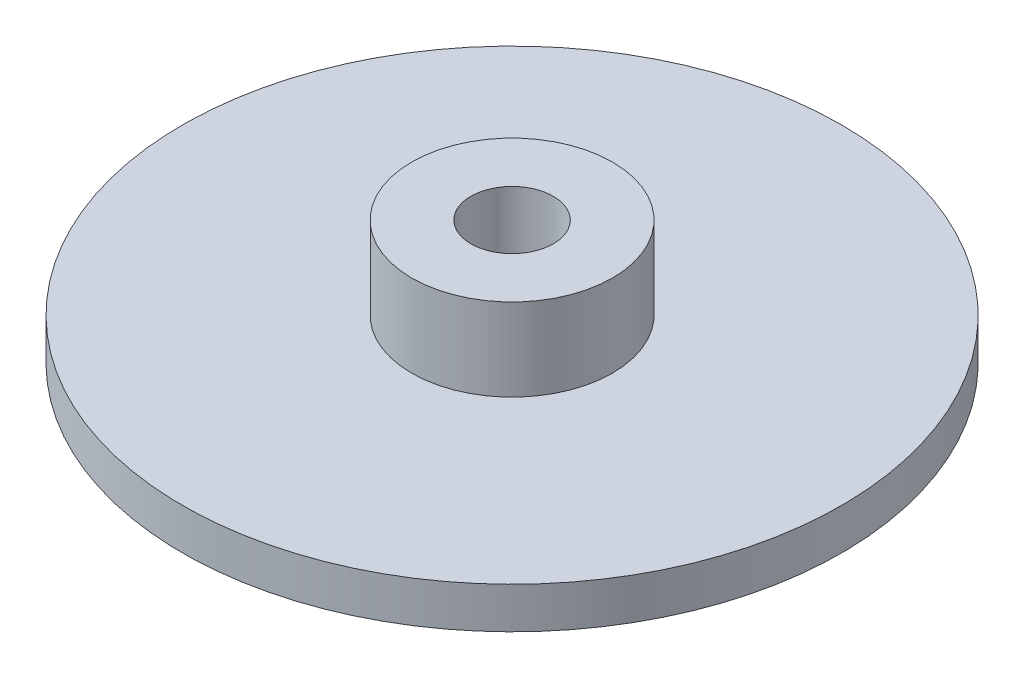
ISO-10303-21;
HEADER;
FILE_DESCRIPTION(('STEP AP214'),'2;1');
FILE_NAME('part.step','',(''),(''),'','','');
FILE_SCHEMA(('AUTOMOTIVE_DESIGN { 1 0 10303 214 1 1 1 1 }'));
ENDSEC;
DATA;
#1=APPLICATION_CONTEXT('core data for automotive mechanical design processes');
#2=APPLICATION_PROTOCOL_DEFINITION('international standard','automotive_design',2000,#1);
#3=PRODUCT_CONTEXT('',#1,'mechanical');
#4=PRODUCT('Part','Part','',(#3));
#5=PRODUCT_RELATED_PRODUCT_CATEGORY('part','',(#4));
#6=PRODUCT_DEFINITION_FORMATION('','',#4);
#7=PRODUCT_DEFINITION_CONTEXT('part definition',#1,'design');
#8=PRODUCT_DEFINITION('design','',#6,#7);
#9=PRODUCT_DEFINITION_SHAPE('','',#8);
#10=(LENGTH_UNIT() NAMED_UNIT(*) SI_UNIT(.MILLI.,.METRE.));
#11=(NAMED_UNIT(*) PLANE_ANGLE_UNIT() SI_UNIT($,.RADIAN.));
#12=(NAMED_UNIT(*) SI_UNIT($,.STERADIAN.) SOLID_ANGLE_UNIT());
#13=UNCERTAINTY_MEASURE_WITH_UNIT(LENGTH_MEASURE(1.E-05),#10,'distance_accuracy_value','');
#14=(GEOMETRIC_REPRESENTATION_CONTEXT(3) GLOBAL_UNCERTAINTY_ASSIGNED_CONTEXT((#13)) GLOBAL_UNIT_ASSIGNED_CONTEXT((#10,
#11,#12)) REPRESENTATION_CONTEXT('',''));
#15=CARTESIAN_POINT('',(0.,0.,0.));
#16=DIRECTION('',(0.,0.,1.));
#17=DIRECTION('',(1.,0.,0.));
#18=AXIS2_PLACEMENT_3D('',#15,#16,#17);
#19=CARTESIAN_POINT('',(0.,9.525,0.));
#20=DIRECTION('',(0.,-1.,0.));
#21=DIRECTION('',(0.,0.,-1.));
#22=AXIS2_PLACEMENT_3D('',#19,#20,#21);
#23=CYLINDRICAL_SURFACE('',#22,7.7390625);
#24=CARTESIAN_POINT('',(0.,3.175,0.));
#25=DIRECTION('',(0.,-1.,0.));
#26=DIRECTION('',(0.,0.,-1.));
#27=AXIS2_PLACEMENT_3D('',#24,#25,#26);
#28=CIRCLE('',#27,7.7390625);
#29=CARTESIAN_POINT('',(0.,3.175,-7.7390625));
#30=VERTEX_POINT('',#29);
#31=EDGE_CURVE('E33',#30,#30,#28,.T.);
#32=ORIENTED_EDGE('',*,*,#31,.F.);
#33=EDGE_LOOP('',(#32));
#34=FACE_BOUND('',#33,.T.);
#35=CARTESIAN_POINT('',(0.,9.525,0.));
#36=DIRECTION('',(0.,-1.,0.));
#37=DIRECTION('',(0.,0.,-1.));
#38=AXIS2_PLACEMENT_3D('',#35,#36,#37);
#39=CIRCLE('',#38,7.7390625);
#40=CARTESIAN_POINT('',(0.,9.525,-7.7390625));
#41=VERTEX_POINT('',#40);
#42=EDGE_CURVE('E17',#41,#41,#39,.F.);
#43=ORIENTED_EDGE('',*,*,#42,.F.);
#44=EDGE_LOOP('',(#43));
#45=FACE_BOUND('',#44,.T.);
#46=ADVANCED_FACE('F14',(#34,#45),#23,.T.);
#47=CARTESIAN_POINT('',(0.,9.525,0.));
#48=DIRECTION('',(0.,1.,0.));
#49=DIRECTION('',(0.,0.,1.));
#50=AXIS2_PLACEMENT_3D('',#47,#48,#49);
#51=PLANE('',#50);
#52=ORIENTED_EDGE('',*,*,#42,.T.);
#53=EDGE_LOOP('',(#52));
#54=FACE_BOUND('',#53,.T.);
#55=CARTESIAN_POINT('',(0.,9.525,0.));
#56=DIRECTION('',(0.,1.,0.));
#57=DIRECTION('',(0.,0.,1.));
#58=AXIS2_PLACEMENT_3D('',#55,#56,#57);
#59=CIRCLE('',#58,3.175);
#60=CARTESIAN_POINT('',(0.,9.525,3.175));
#61=VERTEX_POINT('',#60);
#62=EDGE_CURVE('E31',#61,#61,#59,.F.);
#63=ORIENTED_EDGE('',*,*,#62,.T.);
#64=EDGE_LOOP('',(#63));
#65=FACE_BOUND('',#64,.T.);
#66=ADVANCED_FACE('F40',(#54,#65),#51,.T.);
#67=CARTESIAN_POINT('',(0.,3.175,0.));
#68=DIRECTION('',(0.,1.,0.));
#69=DIRECTION('',(0.,0.,1.));
#70=AXIS2_PLACEMENT_3D('',#67,#68,#69);
#71=PLANE('',#70);
#72=ORIENTED_EDGE('',*,*,#31,.T.);
#73=EDGE_LOOP('',(#72));
#74=FACE_BOUND('',#73,.T.);
#75=CARTESIAN_POINT('',(0.,3.175,0.));
#76=DIRECTION('',(0.,-1.,0.));
#77=DIRECTION('',(0.,0.,-1.));
#78=AXIS2_PLACEMENT_3D('',#75,#76,#77);
#79=CIRCLE('',#78,25.4);
#80=CARTESIAN_POINT('',(0.,3.175,-25.4));
#81=VERTEX_POINT('',#80);
#82=EDGE_CURVE('E26',#81,#81,#79,.T.);
#83=ORIENTED_EDGE('',*,*,#82,.F.);
#84=EDGE_LOOP('',(#83));
#85=FACE_BOUND('',#84,.T.);
#86=ADVANCED_FACE('F49',(#74,#85),#71,.T.);
#87=CARTESIAN_POINT('',(0.,0.,0.));
#88=DIRECTION('',(0.,1.,0.));
#89=DIRECTION('',(0.,0.,1.));
#90=AXIS2_PLACEMENT_3D('',#87,#88,#89);
#91=CYLINDRICAL_SURFACE('',#90,3.175);
#92=CARTESIAN_POINT('',(0.,0.,0.));
#93=DIRECTION('',(0.,1.,0.));
#94=DIRECTION('',(0.,0.,1.));
#95=AXIS2_PLACEMENT_3D('',#92,#93,#94);
#96=CIRCLE('',#95,3.175);
#97=CARTESIAN_POINT('',(0.,0.,3.175));
#98=VERTEX_POINT('',#97);
#99=EDGE_CURVE('E21',#98,#98,#96,.F.);
#100=ORIENTED_EDGE('',*,*,#99,.T.);
#101=EDGE_LOOP('',(#100));
#102=FACE_BOUND('',#101,.T.);
#103=ORIENTED_EDGE('',*,*,#62,.F.);
#104=EDGE_LOOP('',(#103));
#105=FACE_BOUND('',#104,.T.);
#106=ADVANCED_FACE('F58',(#102,#105),#91,.F.);
#107=CARTESIAN_POINT('',(0.,3.175,0.));
#108=DIRECTION('',(0.,-1.,0.));
#109=DIRECTION('',(0.,0.,-1.));
#110=AXIS2_PLACEMENT_3D('',#107,#108,#109);
#111=CYLINDRICAL_SURFACE('',#110,25.4);
#112=ORIENTED_EDGE('',*,*,#82,.T.);
#113=EDGE_LOOP('',(#112));
#114=FACE_BOUND('',#113,.T.);
#115=CARTESIAN_POINT('',(0.,0.,0.));
#116=DIRECTION('',(0.,-1.,0.));
#117=DIRECTION('',(0.,0.,-1.));
#118=AXIS2_PLACEMENT_3D('',#115,#116,#117);
#119=CIRCLE('',#118,25.4);
#120=CARTESIAN_POINT('',(0.,0.,-25.4));
#121=VERTEX_POINT('',#120);
#122=EDGE_CURVE('E10',#121,#121,#119,.F.);
#123=ORIENTED_EDGE('',*,*,#122,.T.);
#124=EDGE_LOOP('',(#123));
#125=FACE_BOUND('',#124,.T.);
#126=ADVANCED_FACE('F52',(#114,#125),#111,.T.);
#127=CARTESIAN_POINT('',(0.,0.,0.));
#128=DIRECTION('',(0.,1.,0.));
#129=DIRECTION('',(0.,0.,1.));
#130=AXIS2_PLACEMENT_3D('',#127,#128,#129);
#131=PLANE('',#130);
#132=ORIENTED_EDGE('',*,*,#122,.F.);
#133=EDGE_LOOP('',(#132));
#134=FACE_BOUND('',#133,.T.);
#135=ORIENTED_EDGE('',*,*,#99,.F.);
#136=EDGE_LOOP('',(#135));
#137=FACE_BOUND('',#136,.T.);
#138=ADVANCED_FACE('F50',(#134,#137),#131,.F.);
#139=CLOSED_SHELL('',(#46,#66,#86,#106,#126,#138));
#140=MANIFOLD_SOLID_BREP('B1',#139);
#141=ADVANCED_BREP_SHAPE_REPRESENTATION('',(#18,#140),#14);
#142=SHAPE_DEFINITION_REPRESENTATION(#9,#141);
ENDSEC;
END-ISO-10303-21;
